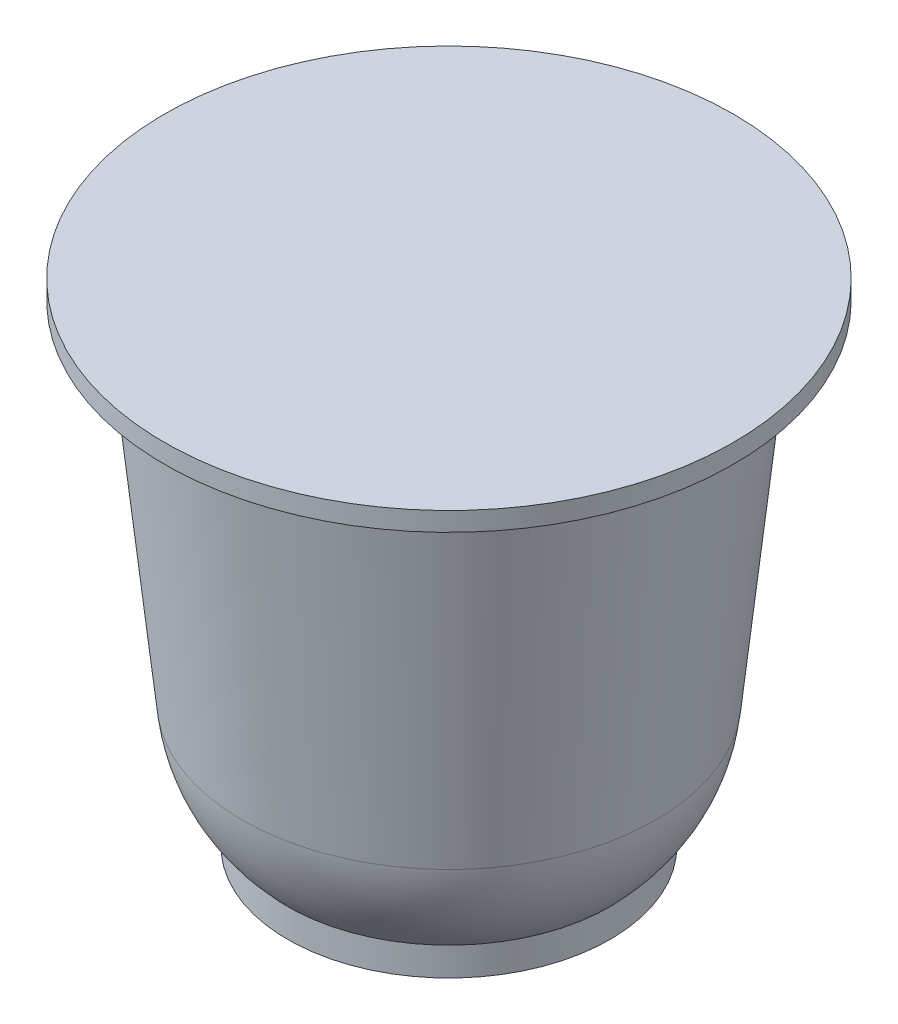
ISO-10303-21;
HEADER;
FILE_DESCRIPTION(('STEP AP214'),'2;1');
FILE_NAME('part.step','',(''),(''),'','','');
FILE_SCHEMA(('AUTOMOTIVE_DESIGN { 1 0 10303 214 1 1 1 1 }'));
ENDSEC;
DATA;
#1=APPLICATION_CONTEXT('core data for automotive mechanical design processes');
#2=APPLICATION_PROTOCOL_DEFINITION('international standard','automotive_design',2000,#1);
#3=PRODUCT_CONTEXT('',#1,'mechanical');
#4=PRODUCT('Part','Part','',(#3));
#5=PRODUCT_RELATED_PRODUCT_CATEGORY('part','',(#4));
#6=PRODUCT_DEFINITION_FORMATION('','',#4);
#7=PRODUCT_DEFINITION_CONTEXT('part definition',#1,'design');
#8=PRODUCT_DEFINITION('design','',#6,#7);
#9=PRODUCT_DEFINITION_SHAPE('','',#8);
#10=(LENGTH_UNIT() NAMED_UNIT(*) SI_UNIT(.MILLI.,.METRE.));
#11=(NAMED_UNIT(*) PLANE_ANGLE_UNIT() SI_UNIT($,.RADIAN.));
#12=(NAMED_UNIT(*) SI_UNIT($,.STERADIAN.) SOLID_ANGLE_UNIT());
#13=UNCERTAINTY_MEASURE_WITH_UNIT(LENGTH_MEASURE(1.E-05),#10,'distance_accuracy_value','');
#14=(GEOMETRIC_REPRESENTATION_CONTEXT(3) GLOBAL_UNCERTAINTY_ASSIGNED_CONTEXT((#13)) GLOBAL_UNIT_ASSIGNED_CONTEXT((#10,
#11,#12)) REPRESENTATION_CONTEXT('',''));
#15=CARTESIAN_POINT('',(0.,0.,0.));
#16=DIRECTION('',(0.,0.,1.));
#17=DIRECTION('',(1.,0.,0.));
#18=AXIS2_PLACEMENT_3D('',#15,#16,#17);
#19=CARTESIAN_POINT('',(0.,0.,0.));
#20=DIRECTION('',(0.,-1.,0.));
#21=DIRECTION('',(0.,0.,-1.));
#22=AXIS2_PLACEMENT_3D('',#19,#20,#21);
#23=PLANE('',#22);
#24=CARTESIAN_POINT('',(0.,0.,0.));
#25=DIRECTION('',(0.,-1.,0.));
#26=DIRECTION('',(0.,0.,-1.));
#27=AXIS2_PLACEMENT_3D('',#24,#25,#26);
#28=CIRCLE('',#27,8.636);
#29=CARTESIAN_POINT('',(0.,0.,-8.636));
#30=VERTEX_POINT('',#29);
#31=EDGE_CURVE('E72',#30,#30,#28,.T.);
#32=ORIENTED_EDGE('',*,*,#31,.T.);
#33=EDGE_LOOP('',(#32));
#34=FACE_BOUND('',#33,.T.);
#35=ADVANCED_FACE('F45',(#34),#23,.T.);
#36=CARTESIAN_POINT('',(0.,26.3652,0.));
#37=DIRECTION('',(0.,1.,0.));
#38=DIRECTION('',(0.,0.,1.));
#39=AXIS2_PLACEMENT_3D('',#36,#37,#38);
#40=PLANE('',#39);
#41=CARTESIAN_POINT('',(0.,26.3652,0.));
#42=DIRECTION('',(0.,-1.,0.));
#43=DIRECTION('',(0.,0.,-1.));
#44=AXIS2_PLACEMENT_3D('',#41,#42,#43);
#45=CIRCLE('',#44,15.24);
#46=CARTESIAN_POINT('',(0.,26.3652,-15.24));
#47=VERTEX_POINT('',#46);
#48=EDGE_CURVE('E10',#47,#47,#45,.T.);
#49=ORIENTED_EDGE('',*,*,#48,.F.);
#50=EDGE_LOOP('',(#49));
#51=FACE_BOUND('',#50,.T.);
#52=ADVANCED_FACE('F90',(#51),#40,.T.);
#53=CARTESIAN_POINT('',(0.,0.,0.));
#54=DIRECTION('',(0.,-1.,0.));
#55=DIRECTION('',(0.,0.,-1.));
#56=AXIS2_PLACEMENT_3D('',#53,#54,#55);
#57=CYLINDRICAL_SURFACE('',#56,15.24);
#58=ORIENTED_EDGE('',*,*,#48,.T.);
#59=EDGE_LOOP('',(#58));
#60=FACE_BOUND('',#59,.T.);
#61=CARTESIAN_POINT('',(0.,25.3492,0.));
#62=DIRECTION('',(0.,-1.,0.));
#63=DIRECTION('',(0.,0.,-1.));
#64=AXIS2_PLACEMENT_3D('',#61,#62,#63);
#65=CIRCLE('',#64,15.24);
#66=CARTESIAN_POINT('',(0.,25.3492,-15.24));
#67=VERTEX_POINT('',#66);
#68=EDGE_CURVE('E52',#67,#67,#65,.T.);
#69=ORIENTED_EDGE('',*,*,#68,.F.);
#70=EDGE_LOOP('',(#69));
#71=FACE_BOUND('',#70,.T.);
#72=ADVANCED_FACE('F94',(#60,#71),#57,.T.);
#73=CARTESIAN_POINT('',(15.24,25.3492,0.));
#74=DIRECTION('',(0.,-1.,0.));
#75=DIRECTION('',(0.,0.,-1.));
#76=AXIS2_PLACEMENT_3D('',#73,#74,#75);
#77=PLANE('',#76);
#78=ORIENTED_EDGE('',*,*,#68,.T.);
#79=EDGE_LOOP('',(#78));
#80=FACE_BOUND('',#79,.T.);
#81=CARTESIAN_POINT('',(0.,25.3492,0.));
#82=DIRECTION('',(0.,-1.,0.));
#83=DIRECTION('',(0.,0.,-1.));
#84=AXIS2_PLACEMENT_3D('',#81,#82,#83);
#85=CIRCLE('',#84,13.011421866224);
#86=CARTESIAN_POINT('',(0.,25.3492,-13.011421866224));
#87=VERTEX_POINT('',#86);
#88=EDGE_CURVE('E57',#87,#87,#85,.T.);
#89=ORIENTED_EDGE('',*,*,#88,.F.);
#90=EDGE_LOOP('',(#89));
#91=FACE_BOUND('',#90,.T.);
#92=ADVANCED_FACE('F99',(#80,#91),#77,.T.);
#93=CARTESIAN_POINT('',(0.,6.75772773756226,0.));
#94=DIRECTION('',(0.,1.,0.));
#95=DIRECTION('',(0.,0.,1.));
#96=AXIS2_PLACEMENT_3D('',#93,#94,#95);
#97=CONICAL_SURFACE('',#96,11.0714623449398,0.103970477477409);
#98=ORIENTED_EDGE('',*,*,#88,.T.);
#99=EDGE_LOOP('',(#98));
#100=FACE_BOUND('',#99,.T.);
#101=CARTESIAN_POINT('',(0.,6.75772773756226,0.));
#102=DIRECTION('',(0.,-1.,0.));
#103=DIRECTION('',(0.,0.,-1.));
#104=AXIS2_PLACEMENT_3D('',#101,#102,#103);
#105=CIRCLE('',#104,11.0714623449398);
#106=CARTESIAN_POINT('',(0.,6.75772773756226,-11.0714623449398));
#107=VERTEX_POINT('',#106);
#108=EDGE_CURVE('E62',#107,#107,#105,.T.);
#109=ORIENTED_EDGE('',*,*,#108,.F.);
#110=EDGE_LOOP('',(#109));
#111=FACE_BOUND('',#110,.T.);
#112=ADVANCED_FACE('F86',(#100,#111),#97,.T.);
#113=CARTESIAN_POINT('',(0.,7.67811055181011,0.));
#114=DIRECTION('',(0.,-1.,0.));
#115=DIRECTION('',(0.,0.,-1.));
#116=AXIS2_PLACEMENT_3D('',#113,#114,#115);
#117=DEGENERATE_TOROIDAL_SURFACE('',#116,2.25103523077686,8.868316582138,.T.);
#118=ORIENTED_EDGE('',*,*,#108,.T.);
#119=EDGE_LOOP('',(#118));
#120=FACE_BOUND('',#119,.T.);
#121=CARTESIAN_POINT('',(0.,1.52349733107859,0.));
#122=DIRECTION('',(0.,-1.,0.));
#123=DIRECTION('',(0.,0.,-1.));
#124=AXIS2_PLACEMENT_3D('',#121,#122,#123);
#125=CIRCLE('',#124,8.636);
#126=CARTESIAN_POINT('',(0.,1.52349733107859,-8.636));
#127=VERTEX_POINT('',#126);
#128=EDGE_CURVE('E68',#127,#127,#125,.T.);
#129=ORIENTED_EDGE('',*,*,#128,.F.);
#130=EDGE_LOOP('',(#129));
#131=FACE_BOUND('',#130,.T.);
#132=ADVANCED_FACE('F80',(#120,#131),#117,.T.);
#133=CARTESIAN_POINT('',(0.,0.,0.));
#134=DIRECTION('',(0.,-1.,0.));
#135=DIRECTION('',(0.,0.,-1.));
#136=AXIS2_PLACEMENT_3D('',#133,#134,#135);
#137=CYLINDRICAL_SURFACE('',#136,8.636);
#138=ORIENTED_EDGE('',*,*,#128,.T.);
#139=EDGE_LOOP('',(#138));
#140=FACE_BOUND('',#139,.T.);
#141=ORIENTED_EDGE('',*,*,#31,.F.);
#142=EDGE_LOOP('',(#141));
#143=FACE_BOUND('',#142,.T.);
#144=ADVANCED_FACE('F78',(#140,#143),#137,.T.);
#145=CLOSED_SHELL('',(#35,#52,#72,#92,#112,#132,#144));
#146=MANIFOLD_SOLID_BREP('B2',#145);
#147=ADVANCED_BREP_SHAPE_REPRESENTATION('',(#18,#146),#14);
#148=SHAPE_DEFINITION_REPRESENTATION(#9,#147);
ENDSEC;
END-ISO-10303-21;
